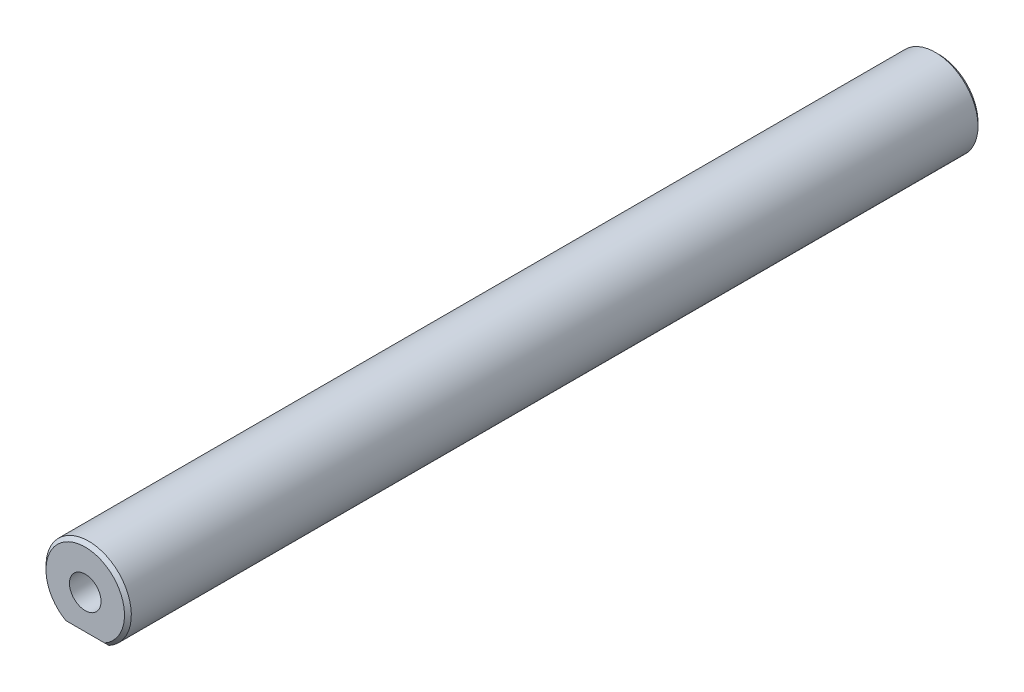
ISO-10303-21;
HEADER;
FILE_DESCRIPTION(('STEP AP214'),'2;1');
FILE_NAME('part.step','',(''),(''),'','','');
FILE_SCHEMA(('AUTOMOTIVE_DESIGN { 1 0 10303 214 1 1 1 1 }'));
ENDSEC;
DATA;
#1=APPLICATION_CONTEXT('core data for automotive mechanical design processes');
#2=APPLICATION_PROTOCOL_DEFINITION('international standard','automotive_design',2000,#1);
#3=PRODUCT_CONTEXT('',#1,'mechanical');
#4=PRODUCT('Part','Part','',(#3));
#5=PRODUCT_RELATED_PRODUCT_CATEGORY('part','',(#4));
#6=PRODUCT_DEFINITION_FORMATION('','',#4);
#7=PRODUCT_DEFINITION_CONTEXT('part definition',#1,'design');
#8=PRODUCT_DEFINITION('design','',#6,#7);
#9=PRODUCT_DEFINITION_SHAPE('','',#8);
#10=(LENGTH_UNIT() NAMED_UNIT(*) SI_UNIT(.MILLI.,.METRE.));
#11=(NAMED_UNIT(*) PLANE_ANGLE_UNIT() SI_UNIT($,.RADIAN.));
#12=(NAMED_UNIT(*) SI_UNIT($,.STERADIAN.) SOLID_ANGLE_UNIT());
#13=UNCERTAINTY_MEASURE_WITH_UNIT(LENGTH_MEASURE(1.E-05),#10,'distance_accuracy_value','');
#14=(GEOMETRIC_REPRESENTATION_CONTEXT(3) GLOBAL_UNCERTAINTY_ASSIGNED_CONTEXT((#13)) GLOBAL_UNIT_ASSIGNED_CONTEXT((#10,
#11,#12)) REPRESENTATION_CONTEXT('',''));
#15=CARTESIAN_POINT('',(0.,0.,0.));
#16=DIRECTION('',(0.,0.,1.));
#17=DIRECTION('',(1.,0.,0.));
#18=AXIS2_PLACEMENT_3D('',#15,#16,#17);
#19=CARTESIAN_POINT('',(0.,0.,50.));
#20=DIRECTION('',(0.,0.,-1.));
#21=DIRECTION('',(-1.,0.,0.));
#22=AXIS2_PLACEMENT_3D('',#19,#20,#21);
#23=CYLINDRICAL_SURFACE('',#22,5.);
#24=DIRECTION('',(0.,0.,1.));
#25=VECTOR('',#24,1.);
#26=CARTESIAN_POINT('',(2.37486841740758,-4.4,-50.));
#27=LINE('',#26,#25);
#28=CARTESIAN_POINT('',(2.37486841740758,-4.4,-49.6));
#29=VERTEX_POINT('',#28);
#30=CARTESIAN_POINT('',(2.37486841740758,-4.4,49.6));
#31=VERTEX_POINT('',#30);
#32=EDGE_CURVE('E179',#29,#31,#27,.T.);
#33=ORIENTED_EDGE('',*,*,#32,.F.);
#34=CARTESIAN_POINT('',(0.,0.,-49.6));
#35=DIRECTION('',(0.,0.,1.));
#36=DIRECTION('',(1.,0.,0.));
#37=AXIS2_PLACEMENT_3D('',#34,#35,#36);
#38=CIRCLE('',#37,5.);
#39=CARTESIAN_POINT('',(-2.37486841740758,-4.4,-49.6));
#40=VERTEX_POINT('',#39);
#41=EDGE_CURVE('E128',#29,#40,#38,.T.);
#42=ORIENTED_EDGE('',*,*,#41,.T.);
#43=DIRECTION('',(0.,0.,1.));
#44=VECTOR('',#43,1.);
#45=CARTESIAN_POINT('',(-2.37486841740758,-4.4,-50.));
#46=LINE('',#45,#44);
#47=CARTESIAN_POINT('',(-2.37486841740758,-4.4,49.6));
#48=VERTEX_POINT('',#47);
#49=EDGE_CURVE('E109',#40,#48,#46,.T.);
#50=ORIENTED_EDGE('',*,*,#49,.T.);
#51=CARTESIAN_POINT('',(0.,0.,49.6));
#52=DIRECTION('',(0.,0.,1.));
#53=DIRECTION('',(1.,0.,0.));
#54=AXIS2_PLACEMENT_3D('',#51,#52,#53);
#55=CIRCLE('',#54,5.);
#56=EDGE_CURVE('E126',#48,#31,#55,.F.);
#57=ORIENTED_EDGE('',*,*,#56,.T.);
#58=EDGE_LOOP('',(#33,#42,#50,#57));
#59=FACE_BOUND('',#58,.T.);
#60=ADVANCED_FACE('F41',(#59),#23,.T.);
#61=CARTESIAN_POINT('',(0.,0.,50.));
#62=DIRECTION('',(0.,0.,1.));
#63=DIRECTION('',(1.,0.,0.));
#64=AXIS2_PLACEMENT_3D('',#61,#62,#63);
#65=PLANE('',#64);
#66=CARTESIAN_POINT('',(0.,0.,50.));
#67=DIRECTION('',(0.,0.,1.));
#68=DIRECTION('',(1.,0.,0.));
#69=AXIS2_PLACEMENT_3D('',#66,#67,#68);
#70=CIRCLE('',#69,4.60000000000002);
#71=CARTESIAN_POINT('',(2.2715633383202,-3.99999999999997,50.));
#72=VERTEX_POINT('',#71);
#73=CARTESIAN_POINT('',(-2.2715633383202,-3.99999999999997,50.));
#74=VERTEX_POINT('',#73);
#75=EDGE_CURVE('E56',#72,#74,#70,.T.);
#76=ORIENTED_EDGE('',*,*,#75,.T.);
#77=DIRECTION('',(1.,0.,0.));
#78=VECTOR('',#77,1.);
#79=CARTESIAN_POINT('',(2.37486841740758,-4.00000000000002,50.));
#80=LINE('',#79,#78);
#81=EDGE_CURVE('E11',#74,#72,#80,.T.);
#82=ORIENTED_EDGE('',*,*,#81,.T.);
#83=EDGE_LOOP('',(#76,#82));
#84=FACE_BOUND('',#83,.T.);
#85=CARTESIAN_POINT('',(0.,0.,50.));
#86=DIRECTION('',(0.,0.,1.));
#87=DIRECTION('',(1.,0.,0.));
#88=AXIS2_PLACEMENT_3D('',#85,#86,#87);
#89=CIRCLE('',#88,1.85);
#90=CARTESIAN_POINT('',(1.85,0.,50.));
#91=VERTEX_POINT('',#90);
#92=EDGE_CURVE('E102',#91,#91,#89,.T.);
#93=ORIENTED_EDGE('',*,*,#92,.F.);
#94=EDGE_LOOP('',(#93));
#95=FACE_BOUND('',#94,.T.);
#96=ADVANCED_FACE('F192',(#84,#95),#65,.T.);
#97=CARTESIAN_POINT('',(0.,0.,-50.));
#98=DIRECTION('',(0.,0.,1.));
#99=DIRECTION('',(1.,0.,0.));
#100=AXIS2_PLACEMENT_3D('',#97,#98,#99);
#101=PLANE('',#100);
#102=CARTESIAN_POINT('',(0.,0.,-50.));
#103=DIRECTION('',(0.,0.,1.));
#104=DIRECTION('',(1.,0.,0.));
#105=AXIS2_PLACEMENT_3D('',#102,#103,#104);
#106=CIRCLE('',#105,4.59999999999998);
#107=CARTESIAN_POINT('',(-2.27156333832019,-3.99999999999993,-50.));
#108=VERTEX_POINT('',#107);
#109=CARTESIAN_POINT('',(2.27156333832019,-3.99999999999993,-50.));
#110=VERTEX_POINT('',#109);
#111=EDGE_CURVE('E115',#108,#110,#106,.F.);
#112=ORIENTED_EDGE('',*,*,#111,.T.);
#113=DIRECTION('',(-1.,0.,0.));
#114=VECTOR('',#113,1.);
#115=CARTESIAN_POINT('',(0.,-3.99999999999998,-50.));
#116=LINE('',#115,#114);
#117=EDGE_CURVE('E117',#110,#108,#116,.T.);
#118=ORIENTED_EDGE('',*,*,#117,.T.);
#119=EDGE_LOOP('',(#112,#118));
#120=FACE_BOUND('',#119,.T.);
#121=CARTESIAN_POINT('',(0.,0.,-50.));
#122=DIRECTION('',(0.,0.,-1.));
#123=DIRECTION('',(-1.,0.,0.));
#124=AXIS2_PLACEMENT_3D('',#121,#122,#123);
#125=CIRCLE('',#124,1.85);
#126=CARTESIAN_POINT('',(-1.85,0.,-50.));
#127=VERTEX_POINT('',#126);
#128=EDGE_CURVE('E103',#127,#127,#125,.T.);
#129=ORIENTED_EDGE('',*,*,#128,.F.);
#130=EDGE_LOOP('',(#129));
#131=FACE_BOUND('',#130,.T.);
#132=ADVANCED_FACE('F188',(#120,#131),#101,.F.);
#133=CARTESIAN_POINT('',(0.,0.,38.));
#134=DIRECTION('',(0.,0.,1.));
#135=DIRECTION('',(1.,0.,0.));
#136=AXIS2_PLACEMENT_3D('',#133,#134,#135);
#137=CONICAL_SURFACE('',#136,1.85,0.785398163397449);
#138=CARTESIAN_POINT('',(0.,0.,36.15));
#139=VERTEX_POINT('',#138);
#140=VERTEX_LOOP('',#139);
#141=FACE_BOUND('',#140,.T.);
#142=CARTESIAN_POINT('',(0.,0.,38.));
#143=DIRECTION('',(0.,0.,1.));
#144=DIRECTION('',(1.,0.,0.));
#145=AXIS2_PLACEMENT_3D('',#142,#143,#144);
#146=CIRCLE('',#145,1.85);
#147=CARTESIAN_POINT('',(1.85,0.,38.));
#148=VERTEX_POINT('',#147);
#149=EDGE_CURVE('E106',#148,#148,#146,.T.);
#150=ORIENTED_EDGE('',*,*,#149,.T.);
#151=EDGE_LOOP('',(#150));
#152=FACE_BOUND('',#151,.T.);
#153=ADVANCED_FACE('F191',(#141,#152),#137,.F.);
#154=CARTESIAN_POINT('',(0.,0.,50.));
#155=DIRECTION('',(0.,0.,1.));
#156=DIRECTION('',(1.,0.,0.));
#157=AXIS2_PLACEMENT_3D('',#154,#155,#156);
#158=CYLINDRICAL_SURFACE('',#157,1.85);
#159=ORIENTED_EDGE('',*,*,#149,.F.);
#160=EDGE_LOOP('',(#159));
#161=FACE_BOUND('',#160,.T.);
#162=ORIENTED_EDGE('',*,*,#92,.T.);
#163=EDGE_LOOP('',(#162));
#164=FACE_BOUND('',#163,.T.);
#165=ADVANCED_FACE('F96',(#161,#164),#158,.F.);
#166=CARTESIAN_POINT('',(0.,0.,-38.));
#167=DIRECTION('',(0.,0.,-1.));
#168=DIRECTION('',(-1.,0.,0.));
#169=AXIS2_PLACEMENT_3D('',#166,#167,#168);
#170=CONICAL_SURFACE('',#169,1.85,0.785398163397449);
#171=CARTESIAN_POINT('',(0.,0.,-36.15));
#172=VERTEX_POINT('',#171);
#173=VERTEX_LOOP('',#172);
#174=FACE_BOUND('',#173,.T.);
#175=CARTESIAN_POINT('',(0.,0.,-38.));
#176=DIRECTION('',(0.,0.,-1.));
#177=DIRECTION('',(-1.,0.,0.));
#178=AXIS2_PLACEMENT_3D('',#175,#176,#177);
#179=CIRCLE('',#178,1.85);
#180=CARTESIAN_POINT('',(-1.85,0.,-38.));
#181=VERTEX_POINT('',#180);
#182=EDGE_CURVE('E100',#181,#181,#179,.T.);
#183=ORIENTED_EDGE('',*,*,#182,.T.);
#184=EDGE_LOOP('',(#183));
#185=FACE_BOUND('',#184,.T.);
#186=ADVANCED_FACE('F92',(#174,#185),#170,.F.);
#187=CARTESIAN_POINT('',(0.,0.,-50.));
#188=DIRECTION('',(0.,0.,-1.));
#189=DIRECTION('',(-1.,0.,0.));
#190=AXIS2_PLACEMENT_3D('',#187,#188,#189);
#191=CYLINDRICAL_SURFACE('',#190,1.85);
#192=ORIENTED_EDGE('',*,*,#182,.F.);
#193=EDGE_LOOP('',(#192));
#194=FACE_BOUND('',#193,.T.);
#195=ORIENTED_EDGE('',*,*,#128,.T.);
#196=EDGE_LOOP('',(#195));
#197=FACE_BOUND('',#196,.T.);
#198=ADVANCED_FACE('F95',(#194,#197),#191,.F.);
#199=CARTESIAN_POINT('',(-2.37486841740758,-4.4,-50.));
#200=DIRECTION('',(0.,1.,0.));
#201=DIRECTION('',(0.,0.,1.));
#202=AXIS2_PLACEMENT_3D('',#199,#200,#201);
#203=PLANE('',#202);
#204=ORIENTED_EDGE('',*,*,#49,.F.);
#205=DIRECTION('',(1.,0.,0.));
#206=VECTOR('',#205,1.);
#207=CARTESIAN_POINT('',(-2.37486841740758,-4.4,-49.6));
#208=LINE('',#207,#206);
#209=EDGE_CURVE('E123',#40,#29,#208,.T.);
#210=ORIENTED_EDGE('',*,*,#209,.T.);
#211=ORIENTED_EDGE('',*,*,#32,.T.);
#212=DIRECTION('',(-1.,0.,0.));
#213=VECTOR('',#212,1.);
#214=CARTESIAN_POINT('',(-2.37486841740758,-4.4,49.6));
#215=LINE('',#214,#213);
#216=EDGE_CURVE('E120',#31,#48,#215,.T.);
#217=ORIENTED_EDGE('',*,*,#216,.T.);
#218=EDGE_LOOP('',(#204,#210,#211,#217));
#219=FACE_BOUND('',#218,.T.);
#220=ADVANCED_FACE('F177',(#219),#203,.F.);
#221=CARTESIAN_POINT('',(0.,0.,-49.6));
#222=DIRECTION('',(0.,0.,1.));
#223=DIRECTION('',(1.,0.,0.));
#224=AXIS2_PLACEMENT_3D('',#221,#222,#223);
#225=CONICAL_SURFACE('',#224,5.,0.78539816339746);
#226=CARTESIAN_POINT('',(-2.27156333832022,-3.99999999999998,-50.));
#227=CARTESIAN_POINT('',(-2.28915125768973,-4.0666188466944,-49.9333811533056));
#228=CARTESIAN_POINT('',(-2.30655397531972,-4.1332616087392,-49.8667383912608));
#229=CARTESIAN_POINT('',(-2.3409890015631,-4.26659494208792,-49.7334050579121));
#230=CARTESIAN_POINT('',(-2.35802131029561,-4.33328551337645,-49.6667144866235));
#231=CARTESIAN_POINT('',(-2.37486841740774,-4.39999999999998,-49.6));
#232=B_SPLINE_CURVE_WITH_KNOTS('',3,(#226,#227,#228,#229,#230,#231),.UNSPECIFIED.,.F.,.F.,(4,2,
4),(0.,0.287521008661072,0.57504192484814),.UNSPECIFIED.);
#233=EDGE_CURVE('E131',#40,#108,#232,.F.);
#234=ORIENTED_EDGE('',*,*,#233,.F.);
#235=ORIENTED_EDGE('',*,*,#41,.F.);
#236=CARTESIAN_POINT('',(2.37486841740758,-4.4,-49.6));
#237=CARTESIAN_POINT('',(2.35802131029553,-4.33328551337646,-49.6667144866235));
#238=CARTESIAN_POINT('',(2.34098900156306,-4.26659494208793,-49.7334050579121));
#239=CARTESIAN_POINT('',(2.30655397531975,-4.1332616087392,-49.8667383912608));
#240=CARTESIAN_POINT('',(2.28915125768977,-4.06661884669439,-49.9333811533056));
#241=CARTESIAN_POINT('',(2.27156333832025,-3.99999999999998,-50.));
#242=B_SPLINE_CURVE_WITH_KNOTS('',3,(#236,#237,#238,#239,#240,#241),.UNSPECIFIED.,.F.,.F.,(4,2,
4),(0.,0.287520916187067,0.575041924848143),.UNSPECIFIED.);
#243=EDGE_CURVE('E139',#110,#29,#242,.F.);
#244=ORIENTED_EDGE('',*,*,#243,.F.);
#245=ORIENTED_EDGE('',*,*,#111,.F.);
#246=EDGE_LOOP('',(#234,#235,#244,#245));
#247=FACE_BOUND('',#246,.T.);
#248=ADVANCED_FACE('F145',(#247),#225,.T.);
#249=CARTESIAN_POINT('',(0.,-3.99999999999998,-50.));
#250=DIRECTION('',(0.,0.707106781186539,0.707106781186556));
#251=DIRECTION('',(-1.,0.,0.));
#252=AXIS2_PLACEMENT_3D('',#249,#250,#251);
#253=PLANE('',#252);
#254=ORIENTED_EDGE('',*,*,#243,.T.);
#255=ORIENTED_EDGE('',*,*,#209,.F.);
#256=ORIENTED_EDGE('',*,*,#233,.T.);
#257=ORIENTED_EDGE('',*,*,#117,.F.);
#258=EDGE_LOOP('',(#254,#255,#256,#257));
#259=FACE_BOUND('',#258,.T.);
#260=ADVANCED_FACE('F149',(#259),#253,.F.);
#261=CARTESIAN_POINT('',(0.,0.,50.));
#262=DIRECTION('',(0.,0.,-1.));
#263=DIRECTION('',(-1.,0.,0.));
#264=AXIS2_PLACEMENT_3D('',#261,#262,#263);
#265=CONICAL_SURFACE('',#264,4.60000000000002,0.785398163397434);
#266=CARTESIAN_POINT('',(-2.37486841740758,-4.4,49.6));
#267=CARTESIAN_POINT('',(-2.35802131029552,-4.33328551337646,49.6667144866236));
#268=CARTESIAN_POINT('',(-2.34098900156306,-4.26659494208794,49.7334050579121));
#269=CARTESIAN_POINT('',(-2.30655397531975,-4.13326160873923,49.8667383912608));
#270=CARTESIAN_POINT('',(-2.28915125768977,-4.06661884669443,49.9333811533056));
#271=CARTESIAN_POINT('',(-2.27156333832026,-4.00000000000002,50.));
#272=B_SPLINE_CURVE_WITH_KNOTS('',3,(#266,#267,#268,#269,#270,#271),.UNSPECIFIED.,.F.,.F.,(4,2,
4),(0.,0.287520916187043,0.575041924848092),.UNSPECIFIED.);
#273=EDGE_CURVE('E164',#74,#48,#272,.F.);
#274=ORIENTED_EDGE('',*,*,#273,.F.);
#275=ORIENTED_EDGE('',*,*,#75,.F.);
#276=CARTESIAN_POINT('',(2.27156333832023,-4.00000000000002,50.));
#277=CARTESIAN_POINT('',(2.28915125768973,-4.06661884669443,49.9333811533056));
#278=CARTESIAN_POINT('',(2.30655397531972,-4.13326160873923,49.8667383912608));
#279=CARTESIAN_POINT('',(2.34098900156309,-4.26659494208794,49.7334050579121));
#280=CARTESIAN_POINT('',(2.3580213102956,-4.33328551337645,49.6667144866236));
#281=CARTESIAN_POINT('',(2.37486841740773,-4.39999999999998,49.6));
#282=B_SPLINE_CURVE_WITH_KNOTS('',3,(#276,#277,#278,#279,#280,#281),.UNSPECIFIED.,.F.,.F.,(4,2,
4),(0.,0.287521008661046,0.575041924848088),.UNSPECIFIED.);
#283=EDGE_CURVE('E47',#31,#72,#282,.F.);
#284=ORIENTED_EDGE('',*,*,#283,.F.);
#285=ORIENTED_EDGE('',*,*,#56,.F.);
#286=EDGE_LOOP('',(#274,#275,#284,#285));
#287=FACE_BOUND('',#286,.T.);
#288=ADVANCED_FACE('F154',(#287),#265,.T.);
#289=CARTESIAN_POINT('',(-2.37486841740758,-4.4,49.6));
#290=DIRECTION('',(0.,-0.707106781186551,0.707106781186544));
#291=DIRECTION('',(1.,0.,0.));
#292=AXIS2_PLACEMENT_3D('',#289,#290,#291);
#293=PLANE('',#292);
#294=ORIENTED_EDGE('',*,*,#283,.T.);
#295=ORIENTED_EDGE('',*,*,#81,.F.);
#296=ORIENTED_EDGE('',*,*,#273,.T.);
#297=ORIENTED_EDGE('',*,*,#216,.F.);
#298=EDGE_LOOP('',(#294,#295,#296,#297));
#299=FACE_BOUND('',#298,.T.);
#300=ADVANCED_FACE('F44',(#299),#293,.T.);
#301=CLOSED_SHELL('',(#60,#96,#132,#153,#165,#186,#198,#220,#248,#260,#288,#300));
#302=MANIFOLD_SOLID_BREP('B2',#301);
#303=ADVANCED_BREP_SHAPE_REPRESENTATION('',(#18,#302),#14);
#304=SHAPE_DEFINITION_REPRESENTATION(#9,#303);
ENDSEC;
END-ISO-10303-21;
